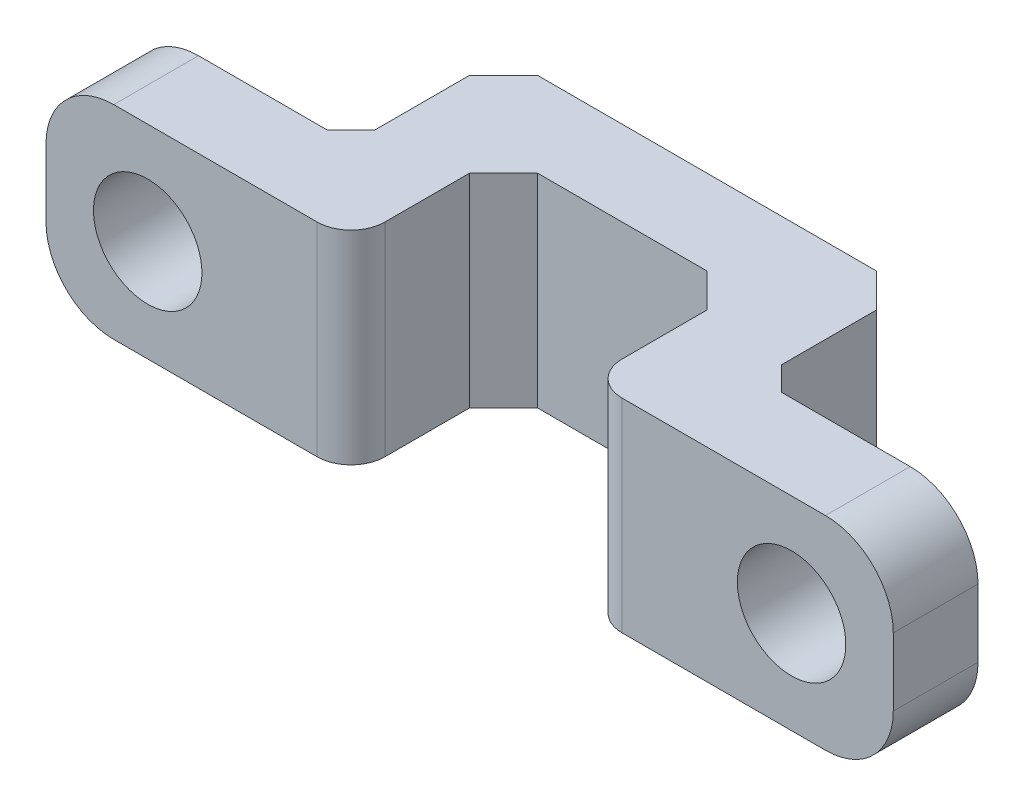
ISO-10303-21;
HEADER;
FILE_DESCRIPTION(('STEP AP214'),'2;1');
FILE_NAME('part.step','',(''),(''),'','','');
FILE_SCHEMA(('AUTOMOTIVE_DESIGN { 1 0 10303 214 1 1 1 1 }'));
ENDSEC;
DATA;
#1=APPLICATION_CONTEXT('core data for automotive mechanical design processes');
#2=APPLICATION_PROTOCOL_DEFINITION('international standard','automotive_design',2000,#1);
#3=PRODUCT_CONTEXT('',#1,'mechanical');
#4=PRODUCT('Part','Part','',(#3));
#5=PRODUCT_RELATED_PRODUCT_CATEGORY('part','',(#4));
#6=PRODUCT_DEFINITION_FORMATION('','',#4);
#7=PRODUCT_DEFINITION_CONTEXT('part definition',#1,'design');
#8=PRODUCT_DEFINITION('design','',#6,#7);
#9=PRODUCT_DEFINITION_SHAPE('','',#8);
#10=(LENGTH_UNIT() NAMED_UNIT(*) SI_UNIT(.MILLI.,.METRE.));
#11=(NAMED_UNIT(*) PLANE_ANGLE_UNIT() SI_UNIT($,.RADIAN.));
#12=(NAMED_UNIT(*) SI_UNIT($,.STERADIAN.) SOLID_ANGLE_UNIT());
#13=UNCERTAINTY_MEASURE_WITH_UNIT(LENGTH_MEASURE(1.E-05),#10,'distance_accuracy_value','');
#14=(GEOMETRIC_REPRESENTATION_CONTEXT(3) GLOBAL_UNCERTAINTY_ASSIGNED_CONTEXT((#13)) GLOBAL_UNIT_ASSIGNED_CONTEXT((#10,
#11,#12)) REPRESENTATION_CONTEXT('',''));
#15=CARTESIAN_POINT('',(0.,0.,0.));
#16=DIRECTION('',(0.,0.,1.));
#17=DIRECTION('',(1.,0.,0.));
#18=AXIS2_PLACEMENT_3D('',#15,#16,#17);
#19=CARTESIAN_POINT('',(-12.5,6.,0.));
#20=DIRECTION('',(-1.,0.,0.));
#21=DIRECTION('',(0.,0.,1.));
#22=AXIS2_PLACEMENT_3D('',#19,#20,#21);
#23=PLANE('',#22);
#24=DIRECTION('',(0.,-1.,0.));
#25=VECTOR('',#24,1.);
#26=CARTESIAN_POINT('',(-12.5,6.,5.75));
#27=LINE('',#26,#25);
#28=CARTESIAN_POINT('',(-12.5,4.,5.75));
#29=VERTEX_POINT('',#28);
#30=CARTESIAN_POINT('',(-12.5,2.,5.75));
#31=VERTEX_POINT('',#30);
#32=EDGE_CURVE('E219',#29,#31,#27,.T.);
#33=ORIENTED_EDGE('',*,*,#32,.F.);
#34=DIRECTION('',(0.,0.,-1.));
#35=VECTOR('',#34,1.);
#36=CARTESIAN_POINT('',(-12.5,4.,0.));
#37=LINE('',#36,#35);
#38=CARTESIAN_POINT('',(-12.5,4.,3.25));
#39=VERTEX_POINT('',#38);
#40=EDGE_CURVE('E277',#29,#39,#37,.T.);
#41=ORIENTED_EDGE('',*,*,#40,.T.);
#42=DIRECTION('',(0.,-1.,0.));
#43=VECTOR('',#42,1.);
#44=CARTESIAN_POINT('',(-12.5,6.,3.25));
#45=LINE('',#44,#43);
#46=CARTESIAN_POINT('',(-12.5,2.,3.25));
#47=VERTEX_POINT('',#46);
#48=EDGE_CURVE('E234',#39,#47,#45,.T.);
#49=ORIENTED_EDGE('',*,*,#48,.T.);
#50=DIRECTION('',(0.,0.,-1.));
#51=VECTOR('',#50,1.);
#52=CARTESIAN_POINT('',(-12.5,2.,5.75));
#53=LINE('',#52,#51);
#54=EDGE_CURVE('E275',#47,#31,#53,.F.);
#55=ORIENTED_EDGE('',*,*,#54,.T.);
#56=EDGE_LOOP('',(#33,#41,#49,#55));
#57=FACE_BOUND('',#56,.T.);
#58=ADVANCED_FACE('F39',(#57),#23,.T.);
#59=CARTESIAN_POINT('',(0.,6.,5.75));
#60=DIRECTION('',(0.,0.,1.));
#61=DIRECTION('',(1.,0.,0.));
#62=AXIS2_PLACEMENT_3D('',#59,#60,#61);
#63=PLANE('',#62);
#64=CARTESIAN_POINT('',(-9.5,3.,5.75));
#65=DIRECTION('',(0.,0.,-1.));
#66=DIRECTION('',(-1.,0.,0.));
#67=AXIS2_PLACEMENT_3D('',#64,#65,#66);
#68=CIRCLE('',#67,1.6);
#69=CARTESIAN_POINT('',(-11.1,3.,5.75));
#70=VERTEX_POINT('',#69);
#71=EDGE_CURVE('E672',#70,#70,#68,.T.);
#72=ORIENTED_EDGE('',*,*,#71,.T.);
#73=EDGE_LOOP('',(#72));
#74=FACE_BOUND('',#73,.T.);
#75=DIRECTION('',(-1.,0.,0.));
#76=VECTOR('',#75,1.);
#77=CARTESIAN_POINT('',(0.,0.,5.75));
#78=LINE('',#77,#76);
#79=CARTESIAN_POINT('',(-4.5,0.,5.75));
#80=VERTEX_POINT('',#79);
#81=CARTESIAN_POINT('',(-10.5,0.,5.75));
#82=VERTEX_POINT('',#81);
#83=EDGE_CURVE('E460',#80,#82,#78,.T.);
#84=ORIENTED_EDGE('',*,*,#83,.F.);
#85=DIRECTION('',(0.,-1.,0.));
#86=VECTOR('',#85,1.);
#87=CARTESIAN_POINT('',(-4.5,6.,5.75));
#88=LINE('',#87,#86);
#89=CARTESIAN_POINT('',(-4.5,6.,5.75));
#90=VERTEX_POINT('',#89);
#91=EDGE_CURVE('E324',#80,#90,#88,.F.);
#92=ORIENTED_EDGE('',*,*,#91,.T.);
#93=DIRECTION('',(-1.,0.,0.));
#94=VECTOR('',#93,1.);
#95=CARTESIAN_POINT('',(0.,6.,5.75));
#96=LINE('',#95,#94);
#97=CARTESIAN_POINT('',(-10.5,6.,5.75));
#98=VERTEX_POINT('',#97);
#99=EDGE_CURVE('E228',#90,#98,#96,.T.);
#100=ORIENTED_EDGE('',*,*,#99,.T.);
#101=CARTESIAN_POINT('',(-10.5,4.,5.75));
#102=DIRECTION('',(0.,0.,1.));
#103=DIRECTION('',(1.,0.,0.));
#104=AXIS2_PLACEMENT_3D('',#101,#102,#103);
#105=CIRCLE('',#104,2.);
#106=EDGE_CURVE('E294',#98,#29,#105,.T.);
#107=ORIENTED_EDGE('',*,*,#106,.T.);
#108=ORIENTED_EDGE('',*,*,#32,.T.);
#109=CARTESIAN_POINT('',(-10.5,2.,5.75));
#110=DIRECTION('',(0.,0.,1.));
#111=DIRECTION('',(1.,0.,0.));
#112=AXIS2_PLACEMENT_3D('',#109,#110,#111);
#113=CIRCLE('',#112,2.);
#114=EDGE_CURVE('E291',#31,#82,#113,.T.);
#115=ORIENTED_EDGE('',*,*,#114,.T.);
#116=EDGE_LOOP('',(#84,#92,#100,#107,#108,#115));
#117=FACE_BOUND('',#116,.T.);
#118=ADVANCED_FACE('F371',(#74,#117),#63,.T.);
#119=CARTESIAN_POINT('',(-3.5,6.,0.));
#120=DIRECTION('',(1.,0.,0.));
#121=DIRECTION('',(0.,0.,-1.));
#122=AXIS2_PLACEMENT_3D('',#119,#120,#121);
#123=PLANE('',#122);
#124=DIRECTION('',(0.,0.,1.));
#125=VECTOR('',#124,1.);
#126=CARTESIAN_POINT('',(-3.5,6.,0.));
#127=LINE('',#126,#125);
#128=CARTESIAN_POINT('',(-3.5,6.,2.25));
#129=VERTEX_POINT('',#128);
#130=CARTESIAN_POINT('',(-3.5,6.,4.75));
#131=VERTEX_POINT('',#130);
#132=EDGE_CURVE('E435',#129,#131,#127,.T.);
#133=ORIENTED_EDGE('',*,*,#132,.T.);
#134=DIRECTION('',(0.,-1.,0.));
#135=VECTOR('',#134,1.);
#136=CARTESIAN_POINT('',(-3.5,6.,4.75));
#137=LINE('',#136,#135);
#138=CARTESIAN_POINT('',(-3.5,0.,4.75));
#139=VERTEX_POINT('',#138);
#140=EDGE_CURVE('E317',#131,#139,#137,.T.);
#141=ORIENTED_EDGE('',*,*,#140,.T.);
#142=DIRECTION('',(0.,0.,1.));
#143=VECTOR('',#142,1.);
#144=CARTESIAN_POINT('',(-3.5,0.,0.));
#145=LINE('',#144,#143);
#146=CARTESIAN_POINT('',(-3.5,0.,2.25));
#147=VERTEX_POINT('',#146);
#148=EDGE_CURVE('E462',#147,#139,#145,.T.);
#149=ORIENTED_EDGE('',*,*,#148,.F.);
#150=DIRECTION('',(0.,1.,0.));
#151=VECTOR('',#150,1.);
#152=CARTESIAN_POINT('',(-3.5,6.,2.25));
#153=LINE('',#152,#151);
#154=EDGE_CURVE('E261',#147,#129,#153,.T.);
#155=ORIENTED_EDGE('',*,*,#154,.T.);
#156=EDGE_LOOP('',(#133,#141,#149,#155));
#157=FACE_BOUND('',#156,.T.);
#158=ADVANCED_FACE('F377',(#157),#123,.T.);
#159=CARTESIAN_POINT('',(0.,6.,1.25));
#160=DIRECTION('',(0.,0.,-1.));
#161=DIRECTION('',(-1.,0.,0.));
#162=AXIS2_PLACEMENT_3D('',#159,#160,#161);
#163=PLANE('',#162);
#164=DIRECTION('',(1.,0.,0.));
#165=VECTOR('',#164,1.);
#166=CARTESIAN_POINT('',(0.,6.,1.25));
#167=LINE('',#166,#165);
#168=CARTESIAN_POINT('',(-2.49999999999999,6.,1.25));
#169=VERTEX_POINT('',#168);
#170=CARTESIAN_POINT('',(2.50000000000001,6.,1.25));
#171=VERTEX_POINT('',#170);
#172=EDGE_CURVE('E440',#169,#171,#167,.T.);
#173=ORIENTED_EDGE('',*,*,#172,.F.);
#174=DIRECTION('',(0.,-1.,0.));
#175=VECTOR('',#174,1.);
#176=CARTESIAN_POINT('',(-2.49999999999999,6.,1.25));
#177=LINE('',#176,#175);
#178=CARTESIAN_POINT('',(-2.49999999999999,0.,1.25));
#179=VERTEX_POINT('',#178);
#180=EDGE_CURVE('E258',#169,#179,#177,.T.);
#181=ORIENTED_EDGE('',*,*,#180,.T.);
#182=DIRECTION('',(1.,0.,0.));
#183=VECTOR('',#182,1.);
#184=CARTESIAN_POINT('',(0.,0.,1.25));
#185=LINE('',#184,#183);
#186=CARTESIAN_POINT('',(2.50000000000001,0.,1.25));
#187=VERTEX_POINT('',#186);
#188=EDGE_CURVE('E465',#179,#187,#185,.T.);
#189=ORIENTED_EDGE('',*,*,#188,.T.);
#190=DIRECTION('',(0.,1.,0.));
#191=VECTOR('',#190,1.);
#192=CARTESIAN_POINT('',(2.50000000000001,6.,1.25));
#193=LINE('',#192,#191);
#194=EDGE_CURVE('E256',#187,#171,#193,.T.);
#195=ORIENTED_EDGE('',*,*,#194,.T.);
#196=EDGE_LOOP('',(#173,#181,#189,#195));
#197=FACE_BOUND('',#196,.T.);
#198=ADVANCED_FACE('F509',(#197),#163,.F.);
#199=CARTESIAN_POINT('',(3.5,6.,0.));
#200=DIRECTION('',(-1.,0.,0.));
#201=DIRECTION('',(0.,0.,1.));
#202=AXIS2_PLACEMENT_3D('',#199,#200,#201);
#203=PLANE('',#202);
#204=DIRECTION('',(0.,0.,-1.));
#205=VECTOR('',#204,1.);
#206=CARTESIAN_POINT('',(3.5,0.,0.));
#207=LINE('',#206,#205);
#208=CARTESIAN_POINT('',(3.5,0.,4.75));
#209=VERTEX_POINT('',#208);
#210=CARTESIAN_POINT('',(3.5,0.,2.25));
#211=VERTEX_POINT('',#210);
#212=EDGE_CURVE('E468',#209,#211,#207,.T.);
#213=ORIENTED_EDGE('',*,*,#212,.F.);
#214=DIRECTION('',(0.,-1.,0.));
#215=VECTOR('',#214,1.);
#216=CARTESIAN_POINT('',(3.5,6.,4.75));
#217=LINE('',#216,#215);
#218=CARTESIAN_POINT('',(3.5,6.,4.75));
#219=VERTEX_POINT('',#218);
#220=EDGE_CURVE('E333',#209,#219,#217,.F.);
#221=ORIENTED_EDGE('',*,*,#220,.T.);
#222=DIRECTION('',(0.,0.,-1.));
#223=VECTOR('',#222,1.);
#224=CARTESIAN_POINT('',(3.5,6.,0.));
#225=LINE('',#224,#223);
#226=CARTESIAN_POINT('',(3.5,6.,2.25));
#227=VERTEX_POINT('',#226);
#228=EDGE_CURVE('E443',#219,#227,#225,.T.);
#229=ORIENTED_EDGE('',*,*,#228,.T.);
#230=DIRECTION('',(0.,-1.,0.));
#231=VECTOR('',#230,1.);
#232=CARTESIAN_POINT('',(3.5,6.,2.25));
#233=LINE('',#232,#231);
#234=EDGE_CURVE('E263',#227,#211,#233,.T.);
#235=ORIENTED_EDGE('',*,*,#234,.T.);
#236=EDGE_LOOP('',(#213,#221,#229,#235));
#237=FACE_BOUND('',#236,.T.);
#238=ADVANCED_FACE('F505',(#237),#203,.T.);
#239=CARTESIAN_POINT('',(0.,6.,5.75));
#240=DIRECTION('',(0.,0.,-1.));
#241=DIRECTION('',(-1.,0.,0.));
#242=AXIS2_PLACEMENT_3D('',#239,#240,#241);
#243=PLANE('',#242);
#244=CARTESIAN_POINT('',(9.5,3.,5.75));
#245=DIRECTION('',(0.,0.,-1.));
#246=DIRECTION('',(-1.,0.,0.));
#247=AXIS2_PLACEMENT_3D('',#244,#245,#246);
#248=CIRCLE('',#247,1.6);
#249=CARTESIAN_POINT('',(7.9,3.,5.75));
#250=VERTEX_POINT('',#249);
#251=EDGE_CURVE('E463',#250,#250,#248,.T.);
#252=ORIENTED_EDGE('',*,*,#251,.T.);
#253=EDGE_LOOP('',(#252));
#254=FACE_BOUND('',#253,.T.);
#255=DIRECTION('',(1.,0.,0.));
#256=VECTOR('',#255,1.);
#257=CARTESIAN_POINT('',(0.,6.,5.75));
#258=LINE('',#257,#256);
#259=CARTESIAN_POINT('',(4.5,6.,5.75));
#260=VERTEX_POINT('',#259);
#261=CARTESIAN_POINT('',(10.5,6.,5.75));
#262=VERTEX_POINT('',#261);
#263=EDGE_CURVE('E449',#260,#262,#258,.T.);
#264=ORIENTED_EDGE('',*,*,#263,.F.);
#265=DIRECTION('',(0.,-1.,0.));
#266=VECTOR('',#265,1.);
#267=CARTESIAN_POINT('',(4.5,0.,5.75));
#268=LINE('',#267,#266);
#269=CARTESIAN_POINT('',(4.5,0.,5.75));
#270=VERTEX_POINT('',#269);
#271=EDGE_CURVE('E330',#260,#270,#268,.T.);
#272=ORIENTED_EDGE('',*,*,#271,.T.);
#273=DIRECTION('',(1.,0.,0.));
#274=VECTOR('',#273,1.);
#275=CARTESIAN_POINT('',(0.,0.,5.75));
#276=LINE('',#275,#274);
#277=CARTESIAN_POINT('',(10.5,0.,5.75));
#278=VERTEX_POINT('',#277);
#279=EDGE_CURVE('E470',#270,#278,#276,.T.);
#280=ORIENTED_EDGE('',*,*,#279,.T.);
#281=CARTESIAN_POINT('',(10.5,2.,5.75));
#282=DIRECTION('',(0.,0.,-1.));
#283=DIRECTION('',(-1.,0.,0.));
#284=AXIS2_PLACEMENT_3D('',#281,#282,#283);
#285=CIRCLE('',#284,2.);
#286=CARTESIAN_POINT('',(12.5,2.,5.75));
#287=VERTEX_POINT('',#286);
#288=EDGE_CURVE('E312',#278,#287,#285,.F.);
#289=ORIENTED_EDGE('',*,*,#288,.T.);
#290=DIRECTION('',(0.,-1.,0.));
#291=VECTOR('',#290,1.);
#292=CARTESIAN_POINT('',(12.5,6.,5.75));
#293=LINE('',#292,#291);
#294=CARTESIAN_POINT('',(12.5,4.,5.75));
#295=VERTEX_POINT('',#294);
#296=EDGE_CURVE('E241',#295,#287,#293,.T.);
#297=ORIENTED_EDGE('',*,*,#296,.F.);
#298=CARTESIAN_POINT('',(10.5,4.,5.75));
#299=DIRECTION('',(0.,0.,-1.));
#300=DIRECTION('',(-1.,0.,0.));
#301=AXIS2_PLACEMENT_3D('',#298,#299,#300);
#302=CIRCLE('',#301,2.);
#303=EDGE_CURVE('E314',#295,#262,#302,.F.);
#304=ORIENTED_EDGE('',*,*,#303,.T.);
#305=EDGE_LOOP('',(#264,#272,#280,#289,#297,#304));
#306=FACE_BOUND('',#305,.T.);
#307=ADVANCED_FACE('F501',(#254,#306),#243,.F.);
#308=CARTESIAN_POINT('',(12.5,6.,0.));
#309=DIRECTION('',(-1.,0.,0.));
#310=DIRECTION('',(0.,0.,1.));
#311=AXIS2_PLACEMENT_3D('',#308,#309,#310);
#312=PLANE('',#311);
#313=DIRECTION('',(0.,-1.,0.));
#314=VECTOR('',#313,1.);
#315=CARTESIAN_POINT('',(12.5,6.,3.25));
#316=LINE('',#315,#314);
#317=CARTESIAN_POINT('',(12.5,4.,3.25));
#318=VERTEX_POINT('',#317);
#319=CARTESIAN_POINT('',(12.5,2.,3.25));
#320=VERTEX_POINT('',#319);
#321=EDGE_CURVE('E237',#318,#320,#316,.T.);
#322=ORIENTED_EDGE('',*,*,#321,.F.);
#323=DIRECTION('',(0.,0.,-1.));
#324=VECTOR('',#323,1.);
#325=CARTESIAN_POINT('',(12.5,4.,5.75));
#326=LINE('',#325,#324);
#327=EDGE_CURVE('E310',#318,#295,#326,.F.);
#328=ORIENTED_EDGE('',*,*,#327,.T.);
#329=ORIENTED_EDGE('',*,*,#296,.T.);
#330=DIRECTION('',(0.,0.,-1.));
#331=VECTOR('',#330,1.);
#332=CARTESIAN_POINT('',(12.5,2.,0.));
#333=LINE('',#332,#331);
#334=EDGE_CURVE('E307',#287,#320,#333,.T.);
#335=ORIENTED_EDGE('',*,*,#334,.T.);
#336=EDGE_LOOP('',(#322,#328,#329,#335));
#337=FACE_BOUND('',#336,.T.);
#338=ADVANCED_FACE('F497',(#337),#312,.F.);
#339=CARTESIAN_POINT('',(0.,6.,3.25));
#340=DIRECTION('',(0.,0.,-1.));
#341=DIRECTION('',(-1.,0.,0.));
#342=AXIS2_PLACEMENT_3D('',#339,#340,#341);
#343=PLANE('',#342);
#344=CARTESIAN_POINT('',(9.5,3.,3.25));
#345=DIRECTION('',(0.,0.,-1.));
#346=DIRECTION('',(-1.,0.,0.));
#347=AXIS2_PLACEMENT_3D('',#344,#345,#346);
#348=CIRCLE('',#347,1.6);
#349=CARTESIAN_POINT('',(7.9,3.,3.25));
#350=VERTEX_POINT('',#349);
#351=EDGE_CURVE('E676',#350,#350,#348,.T.);
#352=ORIENTED_EDGE('',*,*,#351,.F.);
#353=EDGE_LOOP('',(#352));
#354=FACE_BOUND('',#353,.T.);
#355=DIRECTION('',(1.,0.,0.));
#356=VECTOR('',#355,1.);
#357=CARTESIAN_POINT('',(0.,0.,3.25));
#358=LINE('',#357,#356);
#359=CARTESIAN_POINT('',(6.7,0.,3.25));
#360=VERTEX_POINT('',#359);
#361=CARTESIAN_POINT('',(10.5,0.,3.25));
#362=VERTEX_POINT('',#361);
#363=EDGE_CURVE('E472',#360,#362,#358,.T.);
#364=ORIENTED_EDGE('',*,*,#363,.F.);
#365=DIRECTION('',(0.,1.,0.));
#366=VECTOR('',#365,1.);
#367=CARTESIAN_POINT('',(6.7,6.,3.25));
#368=LINE('',#367,#366);
#369=CARTESIAN_POINT('',(6.7,6.,3.25));
#370=VERTEX_POINT('',#369);
#371=EDGE_CURVE('E61',#360,#370,#368,.T.);
#372=ORIENTED_EDGE('',*,*,#371,.T.);
#373=DIRECTION('',(1.,0.,0.));
#374=VECTOR('',#373,1.);
#375=CARTESIAN_POINT('',(0.,6.,3.25));
#376=LINE('',#375,#374);
#377=CARTESIAN_POINT('',(10.5,6.,3.25));
#378=VERTEX_POINT('',#377);
#379=EDGE_CURVE('E451',#370,#378,#376,.T.);
#380=ORIENTED_EDGE('',*,*,#379,.T.);
#381=CARTESIAN_POINT('',(10.5,4.,3.25));
#382=DIRECTION('',(0.,0.,-1.));
#383=DIRECTION('',(-1.,0.,0.));
#384=AXIS2_PLACEMENT_3D('',#381,#382,#383);
#385=CIRCLE('',#384,2.);
#386=EDGE_CURVE('E305',#378,#318,#385,.T.);
#387=ORIENTED_EDGE('',*,*,#386,.T.);
#388=ORIENTED_EDGE('',*,*,#321,.T.);
#389=CARTESIAN_POINT('',(10.5,2.,3.25));
#390=DIRECTION('',(0.,0.,-1.));
#391=DIRECTION('',(-1.,0.,0.));
#392=AXIS2_PLACEMENT_3D('',#389,#390,#391);
#393=CIRCLE('',#392,2.);
#394=EDGE_CURVE('E302',#320,#362,#393,.T.);
#395=ORIENTED_EDGE('',*,*,#394,.T.);
#396=EDGE_LOOP('',(#364,#372,#380,#387,#388,#395));
#397=FACE_BOUND('',#396,.T.);
#398=ADVANCED_FACE('F491',(#354,#397),#343,.T.);
#399=CARTESIAN_POINT('',(6.,6.,0.));
#400=DIRECTION('',(1.,0.,0.));
#401=DIRECTION('',(0.,0.,-1.));
#402=AXIS2_PLACEMENT_3D('',#399,#400,#401);
#403=PLANE('',#402);
#404=DIRECTION('',(0.,0.,1.));
#405=VECTOR('',#404,1.);
#406=CARTESIAN_POINT('',(6.,6.,0.));
#407=LINE('',#406,#405);
#408=CARTESIAN_POINT('',(6.,6.,-0.25));
#409=VERTEX_POINT('',#408);
#410=CARTESIAN_POINT('',(6.,6.,2.55));
#411=VERTEX_POINT('',#410);
#412=EDGE_CURVE('E453',#409,#411,#407,.T.);
#413=ORIENTED_EDGE('',*,*,#412,.T.);
#414=DIRECTION('',(0.,-1.,0.));
#415=VECTOR('',#414,1.);
#416=CARTESIAN_POINT('',(6.,0.,2.55));
#417=LINE('',#416,#415);
#418=CARTESIAN_POINT('',(6.,0.,2.55));
#419=VERTEX_POINT('',#418);
#420=EDGE_CURVE('E340',#411,#419,#417,.T.);
#421=ORIENTED_EDGE('',*,*,#420,.T.);
#422=DIRECTION('',(0.,0.,1.));
#423=VECTOR('',#422,1.);
#424=CARTESIAN_POINT('',(6.,0.,0.));
#425=LINE('',#424,#423);
#426=CARTESIAN_POINT('',(6.,0.,-0.25));
#427=VERTEX_POINT('',#426);
#428=EDGE_CURVE('E230',#427,#419,#425,.T.);
#429=ORIENTED_EDGE('',*,*,#428,.F.);
#430=DIRECTION('',(0.,1.,0.));
#431=VECTOR('',#430,1.);
#432=CARTESIAN_POINT('',(6.,6.,-0.25));
#433=LINE('',#432,#431);
#434=EDGE_CURVE('E254',#427,#409,#433,.T.);
#435=ORIENTED_EDGE('',*,*,#434,.T.);
#436=EDGE_LOOP('',(#413,#421,#429,#435));
#437=FACE_BOUND('',#436,.T.);
#438=ADVANCED_FACE('F476',(#437),#403,.T.);
#439=CARTESIAN_POINT('',(0.,6.,-1.25));
#440=DIRECTION('',(0.,0.,1.));
#441=DIRECTION('',(1.,0.,0.));
#442=AXIS2_PLACEMENT_3D('',#439,#440,#441);
#443=PLANE('',#442);
#444=DIRECTION('',(-1.,0.,0.));
#445=VECTOR('',#444,1.);
#446=CARTESIAN_POINT('',(0.,0.,-1.25));
#447=LINE('',#446,#445);
#448=CARTESIAN_POINT('',(5.,0.,-1.25));
#449=VERTEX_POINT('',#448);
#450=CARTESIAN_POINT('',(-5.,0.,-1.25));
#451=VERTEX_POINT('',#450);
#452=EDGE_CURVE('E226',#449,#451,#447,.T.);
#453=ORIENTED_EDGE('',*,*,#452,.T.);
#454=DIRECTION('',(0.,1.,0.));
#455=VECTOR('',#454,1.);
#456=CARTESIAN_POINT('',(-5.,6.,-1.25));
#457=LINE('',#456,#455);
#458=CARTESIAN_POINT('',(-5.,6.,-1.25));
#459=VERTEX_POINT('',#458);
#460=EDGE_CURVE('E204',#451,#459,#457,.T.);
#461=ORIENTED_EDGE('',*,*,#460,.T.);
#462=DIRECTION('',(-1.,0.,0.));
#463=VECTOR('',#462,1.);
#464=CARTESIAN_POINT('',(0.,6.,-1.25));
#465=LINE('',#464,#463);
#466=CARTESIAN_POINT('',(5.,6.,-1.25));
#467=VERTEX_POINT('',#466);
#468=EDGE_CURVE('E456',#467,#459,#465,.T.);
#469=ORIENTED_EDGE('',*,*,#468,.F.);
#470=DIRECTION('',(0.,-1.,0.));
#471=VECTOR('',#470,1.);
#472=CARTESIAN_POINT('',(5.,0.,-1.25));
#473=LINE('',#472,#471);
#474=EDGE_CURVE('E208',#467,#449,#473,.T.);
#475=ORIENTED_EDGE('',*,*,#474,.T.);
#476=EDGE_LOOP('',(#453,#461,#469,#475));
#477=FACE_BOUND('',#476,.T.);
#478=ADVANCED_FACE('F483',(#477),#443,.F.);
#479=CARTESIAN_POINT('',(-6.,6.,0.));
#480=DIRECTION('',(1.,0.,0.));
#481=DIRECTION('',(0.,0.,-1.));
#482=AXIS2_PLACEMENT_3D('',#479,#480,#481);
#483=PLANE('',#482);
#484=DIRECTION('',(0.,0.,1.));
#485=VECTOR('',#484,1.);
#486=CARTESIAN_POINT('',(-6.,0.,0.));
#487=LINE('',#486,#485);
#488=CARTESIAN_POINT('',(-6.,0.,-0.250000000000002));
#489=VERTEX_POINT('',#488);
#490=CARTESIAN_POINT('',(-6.,0.,2.55));
#491=VERTEX_POINT('',#490);
#492=EDGE_CURVE('E215',#489,#491,#487,.T.);
#493=ORIENTED_EDGE('',*,*,#492,.T.);
#494=DIRECTION('',(0.,1.,0.));
#495=VECTOR('',#494,1.);
#496=CARTESIAN_POINT('',(-6.,6.,2.55));
#497=LINE('',#496,#495);
#498=CARTESIAN_POINT('',(-6.,6.,2.55));
#499=VERTEX_POINT('',#498);
#500=EDGE_CURVE('E338',#491,#499,#497,.T.);
#501=ORIENTED_EDGE('',*,*,#500,.T.);
#502=DIRECTION('',(0.,0.,1.));
#503=VECTOR('',#502,1.);
#504=CARTESIAN_POINT('',(-6.,6.,0.));
#505=LINE('',#504,#503);
#506=CARTESIAN_POINT('',(-6.,6.,-0.250000000000002));
#507=VERTEX_POINT('',#506);
#508=EDGE_CURVE('E218',#507,#499,#505,.T.);
#509=ORIENTED_EDGE('',*,*,#508,.F.);
#510=DIRECTION('',(0.,-1.,0.));
#511=VECTOR('',#510,1.);
#512=CARTESIAN_POINT('',(-6.,6.,-0.250000000000002));
#513=LINE('',#512,#511);
#514=EDGE_CURVE('E203',#507,#489,#513,.T.);
#515=ORIENTED_EDGE('',*,*,#514,.T.);
#516=EDGE_LOOP('',(#493,#501,#509,#515));
#517=FACE_BOUND('',#516,.T.);
#518=ADVANCED_FACE('F214',(#517),#483,.F.);
#519=CARTESIAN_POINT('',(0.,6.,3.25));
#520=DIRECTION('',(0.,0.,1.));
#521=DIRECTION('',(1.,0.,0.));
#522=AXIS2_PLACEMENT_3D('',#519,#520,#521);
#523=PLANE('',#522);
#524=CARTESIAN_POINT('',(-9.5,3.,3.25));
#525=DIRECTION('',(0.,0.,-1.));
#526=DIRECTION('',(-1.,0.,0.));
#527=AXIS2_PLACEMENT_3D('',#524,#525,#526);
#528=CIRCLE('',#527,1.6);
#529=CARTESIAN_POINT('',(-11.1,3.,3.25));
#530=VERTEX_POINT('',#529);
#531=EDGE_CURVE('E675',#530,#530,#528,.T.);
#532=ORIENTED_EDGE('',*,*,#531,.F.);
#533=EDGE_LOOP('',(#532));
#534=FACE_BOUND('',#533,.T.);
#535=DIRECTION('',(-1.,0.,0.));
#536=VECTOR('',#535,1.);
#537=CARTESIAN_POINT('',(0.,6.,3.25));
#538=LINE('',#537,#536);
#539=CARTESIAN_POINT('',(-6.70000000000001,6.,3.25));
#540=VERTEX_POINT('',#539);
#541=CARTESIAN_POINT('',(-10.5,6.,3.25));
#542=VERTEX_POINT('',#541);
#543=EDGE_CURVE('E238',#540,#542,#538,.T.);
#544=ORIENTED_EDGE('',*,*,#543,.F.);
#545=DIRECTION('',(0.,-1.,0.));
#546=VECTOR('',#545,1.);
#547=CARTESIAN_POINT('',(-6.70000000000001,0.,3.25));
#548=LINE('',#547,#546);
#549=CARTESIAN_POINT('',(-6.70000000000001,0.,3.25));
#550=VERTEX_POINT('',#549);
#551=EDGE_CURVE('E335',#540,#550,#548,.T.);
#552=ORIENTED_EDGE('',*,*,#551,.T.);
#553=DIRECTION('',(-1.,0.,0.));
#554=VECTOR('',#553,1.);
#555=CARTESIAN_POINT('',(0.,0.,3.25));
#556=LINE('',#555,#554);
#557=CARTESIAN_POINT('',(-10.5,0.,3.25));
#558=VERTEX_POINT('',#557);
#559=EDGE_CURVE('E225',#550,#558,#556,.T.);
#560=ORIENTED_EDGE('',*,*,#559,.T.);
#561=CARTESIAN_POINT('',(-10.5,2.,3.25));
#562=DIRECTION('',(0.,0.,1.));
#563=DIRECTION('',(1.,0.,0.));
#564=AXIS2_PLACEMENT_3D('',#561,#562,#563);
#565=CIRCLE('',#564,2.);
#566=EDGE_CURVE('E280',#558,#47,#565,.F.);
#567=ORIENTED_EDGE('',*,*,#566,.T.);
#568=ORIENTED_EDGE('',*,*,#48,.F.);
#569=CARTESIAN_POINT('',(-10.5,4.,3.25));
#570=DIRECTION('',(0.,0.,1.));
#571=DIRECTION('',(1.,0.,0.));
#572=AXIS2_PLACEMENT_3D('',#569,#570,#571);
#573=CIRCLE('',#572,2.);
#574=EDGE_CURVE('E282',#39,#542,#573,.F.);
#575=ORIENTED_EDGE('',*,*,#574,.T.);
#576=EDGE_LOOP('',(#544,#552,#560,#567,#568,#575));
#577=FACE_BOUND('',#576,.T.);
#578=ADVANCED_FACE('F354',(#534,#577),#523,.F.);
#579=CARTESIAN_POINT('',(0.,6.,0.));
#580=DIRECTION('',(0.,1.,0.));
#581=DIRECTION('',(0.,0.,1.));
#582=AXIS2_PLACEMENT_3D('',#579,#580,#581);
#583=PLANE('',#582);
#584=ORIENTED_EDGE('',*,*,#99,.F.);
#585=CARTESIAN_POINT('',(-4.5,6.,4.75));
#586=DIRECTION('',(0.,1.,0.));
#587=DIRECTION('',(0.,0.,1.));
#588=AXIS2_PLACEMENT_3D('',#585,#586,#587);
#589=CIRCLE('',#588,1.);
#590=EDGE_CURVE('E328',#90,#131,#589,.T.);
#591=ORIENTED_EDGE('',*,*,#590,.T.);
#592=ORIENTED_EDGE('',*,*,#132,.F.);
#593=DIRECTION('',(0.707106781186551,0.,-0.707106781186544));
#594=VECTOR('',#593,1.);
#595=CARTESIAN_POINT('',(-2.49999999999999,6.,1.25));
#596=LINE('',#595,#594);
#597=EDGE_CURVE('E268',#129,#169,#596,.T.);
#598=ORIENTED_EDGE('',*,*,#597,.T.);
#599=ORIENTED_EDGE('',*,*,#172,.T.);
#600=DIRECTION('',(0.707106781186544,0.,0.707106781186551));
#601=VECTOR('',#600,1.);
#602=CARTESIAN_POINT('',(3.5,6.,2.25));
#603=LINE('',#602,#601);
#604=EDGE_CURVE('E272',#171,#227,#603,.T.);
#605=ORIENTED_EDGE('',*,*,#604,.T.);
#606=ORIENTED_EDGE('',*,*,#228,.F.);
#607=CARTESIAN_POINT('',(4.5,6.,4.75));
#608=DIRECTION('',(0.,1.,0.));
#609=DIRECTION('',(0.,0.,1.));
#610=AXIS2_PLACEMENT_3D('',#607,#608,#609);
#611=CIRCLE('',#610,1.);
#612=EDGE_CURVE('E326',#219,#260,#611,.T.);
#613=ORIENTED_EDGE('',*,*,#612,.T.);
#614=ORIENTED_EDGE('',*,*,#263,.T.);
#615=DIRECTION('',(0.,0.,-1.));
#616=VECTOR('',#615,1.);
#617=CARTESIAN_POINT('',(10.5,6.,3.25));
#618=LINE('',#617,#616);
#619=EDGE_CURVE('E285',#262,#378,#618,.T.);
#620=ORIENTED_EDGE('',*,*,#619,.T.);
#621=ORIENTED_EDGE('',*,*,#379,.F.);
#622=DIRECTION('',(0.707106781186544,0.,0.707106781186551));
#623=VECTOR('',#622,1.);
#624=CARTESIAN_POINT('',(6.,6.,2.55));
#625=LINE('',#624,#623);
#626=EDGE_CURVE('E11',#370,#411,#625,.F.);
#627=ORIENTED_EDGE('',*,*,#626,.T.);
#628=ORIENTED_EDGE('',*,*,#412,.F.);
#629=DIRECTION('',(-0.707106781186546,0.,-0.707106781186549));
#630=VECTOR('',#629,1.);
#631=CARTESIAN_POINT('',(3.12500000000001,6.,-3.125));
#632=LINE('',#631,#630);
#633=EDGE_CURVE('E250',#409,#467,#632,.T.);
#634=ORIENTED_EDGE('',*,*,#633,.T.);
#635=ORIENTED_EDGE('',*,*,#468,.T.);
#636=DIRECTION('',(0.707106781186549,0.,-0.707106781186546));
#637=VECTOR('',#636,1.);
#638=CARTESIAN_POINT('',(-3.12499999999999,6.,-3.125));
#639=LINE('',#638,#637);
#640=EDGE_CURVE('E252',#459,#507,#639,.F.);
#641=ORIENTED_EDGE('',*,*,#640,.T.);
#642=ORIENTED_EDGE('',*,*,#508,.T.);
#643=DIRECTION('',(0.707106781186553,0.,-0.707106781186542));
#644=VECTOR('',#643,1.);
#645=CARTESIAN_POINT('',(-6.70000000000001,6.,3.25));
#646=LINE('',#645,#644);
#647=EDGE_CURVE('E345',#499,#540,#646,.F.);
#648=ORIENTED_EDGE('',*,*,#647,.T.);
#649=ORIENTED_EDGE('',*,*,#543,.T.);
#650=DIRECTION('',(0.,0.,-1.));
#651=VECTOR('',#650,1.);
#652=CARTESIAN_POINT('',(-10.5,6.,0.));
#653=LINE('',#652,#651);
#654=EDGE_CURVE('E288',#542,#98,#653,.F.);
#655=ORIENTED_EDGE('',*,*,#654,.T.);
#656=EDGE_LOOP('',(#584,#591,#592,#598,#599,#605,#606,#613,#614,#620,#621,#627,#628,#634,#635,
#641,#642,#648,#649,#655));
#657=FACE_BOUND('',#656,.T.);
#658=ADVANCED_FACE('F350',(#657),#583,.T.);
#659=CARTESIAN_POINT('',(0.,0.,0.));
#660=DIRECTION('',(0.,1.,0.));
#661=DIRECTION('',(0.,0.,1.));
#662=AXIS2_PLACEMENT_3D('',#659,#660,#661);
#663=PLANE('',#662);
#664=ORIENTED_EDGE('',*,*,#148,.T.);
#665=CARTESIAN_POINT('',(-4.5,0.,4.75));
#666=DIRECTION('',(0.,1.,0.));
#667=DIRECTION('',(0.,0.,1.));
#668=AXIS2_PLACEMENT_3D('',#665,#666,#667);
#669=CIRCLE('',#668,1.);
#670=EDGE_CURVE('E322',#139,#80,#669,.F.);
#671=ORIENTED_EDGE('',*,*,#670,.T.);
#672=ORIENTED_EDGE('',*,*,#83,.T.);
#673=DIRECTION('',(0.,0.,-1.));
#674=VECTOR('',#673,1.);
#675=CARTESIAN_POINT('',(-10.5,0.,3.25));
#676=LINE('',#675,#674);
#677=EDGE_CURVE('E299',#82,#558,#676,.T.);
#678=ORIENTED_EDGE('',*,*,#677,.T.);
#679=ORIENTED_EDGE('',*,*,#559,.F.);
#680=DIRECTION('',(-0.707106781186553,0.,0.707106781186542));
#681=VECTOR('',#680,1.);
#682=CARTESIAN_POINT('',(-1.72499999999996,0.,-1.72499999999998));
#683=LINE('',#682,#681);
#684=EDGE_CURVE('E224',#550,#491,#683,.F.);
#685=ORIENTED_EDGE('',*,*,#684,.T.);
#686=ORIENTED_EDGE('',*,*,#492,.F.);
#687=DIRECTION('',(-0.707106781186549,0.,0.707106781186546));
#688=VECTOR('',#687,1.);
#689=CARTESIAN_POINT('',(-6.,0.,-0.250000000000002));
#690=LINE('',#689,#688);
#691=EDGE_CURVE('E199',#489,#451,#690,.F.);
#692=ORIENTED_EDGE('',*,*,#691,.T.);
#693=ORIENTED_EDGE('',*,*,#452,.F.);
#694=DIRECTION('',(0.707106781186546,0.,0.707106781186549));
#695=VECTOR('',#694,1.);
#696=CARTESIAN_POINT('',(5.,0.,-1.25));
#697=LINE('',#696,#695);
#698=EDGE_CURVE('E209',#449,#427,#697,.T.);
#699=ORIENTED_EDGE('',*,*,#698,.T.);
#700=ORIENTED_EDGE('',*,*,#428,.T.);
#701=DIRECTION('',(-0.707106781186544,0.,-0.707106781186551));
#702=VECTOR('',#701,1.);
#703=CARTESIAN_POINT('',(1.72500000000003,0.,-1.72500000000001));
#704=LINE('',#703,#702);
#705=EDGE_CURVE('E48',#419,#360,#704,.F.);
#706=ORIENTED_EDGE('',*,*,#705,.T.);
#707=ORIENTED_EDGE('',*,*,#363,.T.);
#708=DIRECTION('',(0.,0.,-1.));
#709=VECTOR('',#708,1.);
#710=CARTESIAN_POINT('',(10.5,0.,0.));
#711=LINE('',#710,#709);
#712=EDGE_CURVE('E296',#362,#278,#711,.F.);
#713=ORIENTED_EDGE('',*,*,#712,.T.);
#714=ORIENTED_EDGE('',*,*,#279,.F.);
#715=CARTESIAN_POINT('',(4.5,0.,4.75));
#716=DIRECTION('',(0.,1.,0.));
#717=DIRECTION('',(0.,0.,1.));
#718=AXIS2_PLACEMENT_3D('',#715,#716,#717);
#719=CIRCLE('',#718,1.);
#720=EDGE_CURVE('E320',#270,#209,#719,.F.);
#721=ORIENTED_EDGE('',*,*,#720,.T.);
#722=ORIENTED_EDGE('',*,*,#212,.T.);
#723=DIRECTION('',(-0.707106781186544,0.,-0.707106781186551));
#724=VECTOR('',#723,1.);
#725=CARTESIAN_POINT('',(0.625000000000017,0.,-0.62500000000001));
#726=LINE('',#725,#724);
#727=EDGE_CURVE('E270',#211,#187,#726,.T.);
#728=ORIENTED_EDGE('',*,*,#727,.T.);
#729=ORIENTED_EDGE('',*,*,#188,.F.);
#730=DIRECTION('',(-0.707106781186551,0.,0.707106781186544));
#731=VECTOR('',#730,1.);
#732=CARTESIAN_POINT('',(-0.624999999999984,0.,-0.62499999999999));
#733=LINE('',#732,#731);
#734=EDGE_CURVE('E266',#179,#147,#733,.T.);
#735=ORIENTED_EDGE('',*,*,#734,.T.);
#736=EDGE_LOOP('',(#664,#671,#672,#678,#679,#685,#686,#692,#693,#699,#700,#706,#707,#713,#714,
#721,#722,#728,#729,#735));
#737=FACE_BOUND('',#736,.T.);
#738=ADVANCED_FACE('F222',(#737),#663,.F.);
#739=CARTESIAN_POINT('',(-9.5,3.,5.75));
#740=DIRECTION('',(0.,0.,-1.));
#741=DIRECTION('',(-1.,0.,0.));
#742=AXIS2_PLACEMENT_3D('',#739,#740,#741);
#743=CYLINDRICAL_SURFACE('',#742,1.6);
#744=ORIENTED_EDGE('',*,*,#71,.F.);
#745=EDGE_LOOP('',(#744));
#746=FACE_BOUND('',#745,.T.);
#747=ORIENTED_EDGE('',*,*,#531,.T.);
#748=EDGE_LOOP('',(#747));
#749=FACE_BOUND('',#748,.T.);
#750=ADVANCED_FACE('F581',(#746,#749),#743,.F.);
#751=CARTESIAN_POINT('',(9.5,3.,5.75));
#752=DIRECTION('',(0.,0.,-1.));
#753=DIRECTION('',(-1.,0.,0.));
#754=AXIS2_PLACEMENT_3D('',#751,#752,#753);
#755=CYLINDRICAL_SURFACE('',#754,1.6);
#756=ORIENTED_EDGE('',*,*,#251,.F.);
#757=EDGE_LOOP('',(#756));
#758=FACE_BOUND('',#757,.T.);
#759=ORIENTED_EDGE('',*,*,#351,.T.);
#760=EDGE_LOOP('',(#759));
#761=FACE_BOUND('',#760,.T.);
#762=ADVANCED_FACE('F390',(#758,#761),#755,.F.);
#763=CARTESIAN_POINT('',(-6.,6.,-0.250000000000002));
#764=DIRECTION('',(0.707106781186546,0.,0.707106781186549));
#765=DIRECTION('',(0.,-1.,0.));
#766=AXIS2_PLACEMENT_3D('',#763,#764,#765);
#767=PLANE('',#766);
#768=ORIENTED_EDGE('',*,*,#640,.F.);
#769=ORIENTED_EDGE('',*,*,#460,.F.);
#770=ORIENTED_EDGE('',*,*,#691,.F.);
#771=ORIENTED_EDGE('',*,*,#514,.F.);
#772=EDGE_LOOP('',(#768,#769,#770,#771));
#773=FACE_BOUND('',#772,.T.);
#774=ADVANCED_FACE('F202',(#773),#767,.F.);
#775=CARTESIAN_POINT('',(5.,6.,-1.25));
#776=DIRECTION('',(0.707106781186549,0.,-0.707106781186546));
#777=DIRECTION('',(0.,1.,0.));
#778=AXIS2_PLACEMENT_3D('',#775,#776,#777);
#779=PLANE('',#778);
#780=ORIENTED_EDGE('',*,*,#633,.F.);
#781=ORIENTED_EDGE('',*,*,#434,.F.);
#782=ORIENTED_EDGE('',*,*,#698,.F.);
#783=ORIENTED_EDGE('',*,*,#474,.F.);
#784=EDGE_LOOP('',(#780,#781,#782,#783));
#785=FACE_BOUND('',#784,.T.);
#786=ADVANCED_FACE('F389',(#785),#779,.T.);
#787=CARTESIAN_POINT('',(-2.49999999999999,6.,1.25));
#788=DIRECTION('',(-0.707106781186544,0.,-0.707106781186551));
#789=DIRECTION('',(0.,-1.,0.));
#790=AXIS2_PLACEMENT_3D('',#787,#788,#789);
#791=PLANE('',#790);
#792=ORIENTED_EDGE('',*,*,#597,.F.);
#793=ORIENTED_EDGE('',*,*,#154,.F.);
#794=ORIENTED_EDGE('',*,*,#734,.F.);
#795=ORIENTED_EDGE('',*,*,#180,.F.);
#796=EDGE_LOOP('',(#792,#793,#794,#795));
#797=FACE_BOUND('',#796,.T.);
#798=ADVANCED_FACE('F396',(#797),#791,.F.);
#799=CARTESIAN_POINT('',(3.5,6.,2.25));
#800=DIRECTION('',(0.707106781186551,0.,-0.707106781186544));
#801=DIRECTION('',(0.,-1.,0.));
#802=AXIS2_PLACEMENT_3D('',#799,#800,#801);
#803=PLANE('',#802);
#804=ORIENTED_EDGE('',*,*,#604,.F.);
#805=ORIENTED_EDGE('',*,*,#194,.F.);
#806=ORIENTED_EDGE('',*,*,#727,.F.);
#807=ORIENTED_EDGE('',*,*,#234,.F.);
#808=EDGE_LOOP('',(#804,#805,#806,#807));
#809=FACE_BOUND('',#808,.T.);
#810=ADVANCED_FACE('F403',(#809),#803,.F.);
#811=CARTESIAN_POINT('',(-10.5,4.,0.));
#812=DIRECTION('',(0.,0.,-1.));
#813=DIRECTION('',(-1.,0.,0.));
#814=AXIS2_PLACEMENT_3D('',#811,#812,#813);
#815=CYLINDRICAL_SURFACE('',#814,2.);
#816=ORIENTED_EDGE('',*,*,#106,.F.);
#817=ORIENTED_EDGE('',*,*,#654,.F.);
#818=ORIENTED_EDGE('',*,*,#574,.F.);
#819=ORIENTED_EDGE('',*,*,#40,.F.);
#820=EDGE_LOOP('',(#816,#817,#818,#819));
#821=FACE_BOUND('',#820,.T.);
#822=ADVANCED_FACE('F409',(#821),#815,.T.);
#823=CARTESIAN_POINT('',(-10.5,2.,0.));
#824=DIRECTION('',(0.,0.,1.));
#825=DIRECTION('',(1.,0.,0.));
#826=AXIS2_PLACEMENT_3D('',#823,#824,#825);
#827=CYLINDRICAL_SURFACE('',#826,2.);
#828=ORIENTED_EDGE('',*,*,#114,.F.);
#829=ORIENTED_EDGE('',*,*,#54,.F.);
#830=ORIENTED_EDGE('',*,*,#566,.F.);
#831=ORIENTED_EDGE('',*,*,#677,.F.);
#832=EDGE_LOOP('',(#828,#829,#830,#831));
#833=FACE_BOUND('',#832,.T.);
#834=ADVANCED_FACE('F413',(#833),#827,.T.);
#835=CARTESIAN_POINT('',(10.5,4.,0.));
#836=DIRECTION('',(0.,0.,1.));
#837=DIRECTION('',(1.,0.,0.));
#838=AXIS2_PLACEMENT_3D('',#835,#836,#837);
#839=CYLINDRICAL_SURFACE('',#838,2.);
#840=ORIENTED_EDGE('',*,*,#303,.F.);
#841=ORIENTED_EDGE('',*,*,#327,.F.);
#842=ORIENTED_EDGE('',*,*,#386,.F.);
#843=ORIENTED_EDGE('',*,*,#619,.F.);
#844=EDGE_LOOP('',(#840,#841,#842,#843));
#845=FACE_BOUND('',#844,.T.);
#846=ADVANCED_FACE('F417',(#845),#839,.T.);
#847=CARTESIAN_POINT('',(10.5,2.,0.));
#848=DIRECTION('',(0.,0.,-1.));
#849=DIRECTION('',(-1.,0.,0.));
#850=AXIS2_PLACEMENT_3D('',#847,#848,#849);
#851=CYLINDRICAL_SURFACE('',#850,2.);
#852=ORIENTED_EDGE('',*,*,#288,.F.);
#853=ORIENTED_EDGE('',*,*,#712,.F.);
#854=ORIENTED_EDGE('',*,*,#394,.F.);
#855=ORIENTED_EDGE('',*,*,#334,.F.);
#856=EDGE_LOOP('',(#852,#853,#854,#855));
#857=FACE_BOUND('',#856,.T.);
#858=ADVANCED_FACE('F421',(#857),#851,.T.);
#859=CARTESIAN_POINT('',(-4.5,6.,4.75));
#860=DIRECTION('',(0.,-1.,0.));
#861=DIRECTION('',(0.,0.,-1.));
#862=AXIS2_PLACEMENT_3D('',#859,#860,#861);
#863=CYLINDRICAL_SURFACE('',#862,1.);
#864=ORIENTED_EDGE('',*,*,#590,.F.);
#865=ORIENTED_EDGE('',*,*,#91,.F.);
#866=ORIENTED_EDGE('',*,*,#670,.F.);
#867=ORIENTED_EDGE('',*,*,#140,.F.);
#868=EDGE_LOOP('',(#864,#865,#866,#867));
#869=FACE_BOUND('',#868,.T.);
#870=ADVANCED_FACE('F366',(#869),#863,.T.);
#871=CARTESIAN_POINT('',(4.5,6.,4.75));
#872=DIRECTION('',(0.,1.,0.));
#873=DIRECTION('',(0.,0.,1.));
#874=AXIS2_PLACEMENT_3D('',#871,#872,#873);
#875=CYLINDRICAL_SURFACE('',#874,1.);
#876=ORIENTED_EDGE('',*,*,#612,.F.);
#877=ORIENTED_EDGE('',*,*,#220,.F.);
#878=ORIENTED_EDGE('',*,*,#720,.F.);
#879=ORIENTED_EDGE('',*,*,#271,.F.);
#880=EDGE_LOOP('',(#876,#877,#878,#879));
#881=FACE_BOUND('',#880,.T.);
#882=ADVANCED_FACE('F360',(#881),#875,.T.);
#883=CARTESIAN_POINT('',(-6.70000000000001,6.,3.25));
#884=DIRECTION('',(-0.707106781186542,0.,-0.707106781186553));
#885=DIRECTION('',(0.,1.,0.));
#886=AXIS2_PLACEMENT_3D('',#883,#884,#885);
#887=PLANE('',#886);
#888=ORIENTED_EDGE('',*,*,#647,.F.);
#889=ORIENTED_EDGE('',*,*,#500,.F.);
#890=ORIENTED_EDGE('',*,*,#684,.F.);
#891=ORIENTED_EDGE('',*,*,#551,.F.);
#892=EDGE_LOOP('',(#888,#889,#890,#891));
#893=FACE_BOUND('',#892,.T.);
#894=ADVANCED_FACE('F358',(#893),#887,.T.);
#895=CARTESIAN_POINT('',(6.,6.,2.55));
#896=DIRECTION('',(0.707106781186551,0.,-0.707106781186544));
#897=DIRECTION('',(0.,1.,0.));
#898=AXIS2_PLACEMENT_3D('',#895,#896,#897);
#899=PLANE('',#898);
#900=ORIENTED_EDGE('',*,*,#626,.F.);
#901=ORIENTED_EDGE('',*,*,#371,.F.);
#902=ORIENTED_EDGE('',*,*,#705,.F.);
#903=ORIENTED_EDGE('',*,*,#420,.F.);
#904=EDGE_LOOP('',(#900,#901,#902,#903));
#905=FACE_BOUND('',#904,.T.);
#906=ADVANCED_FACE('F42',(#905),#899,.T.);
#907=CLOSED_SHELL('',(#58,#118,#158,#198,#238,#307,#338,#398,#438,#478,#518,#578,#658,#738,#750,
#762,#774,#786,#798,#810,#822,#834,#846,#858,#870,#882,#894,#906));
#908=MANIFOLD_SOLID_BREP('B2',#907);
#909=ADVANCED_BREP_SHAPE_REPRESENTATION('',(#18,#908),#14);
#910=SHAPE_DEFINITION_REPRESENTATION(#9,#909);
ENDSEC;
END-ISO-10303-21;
